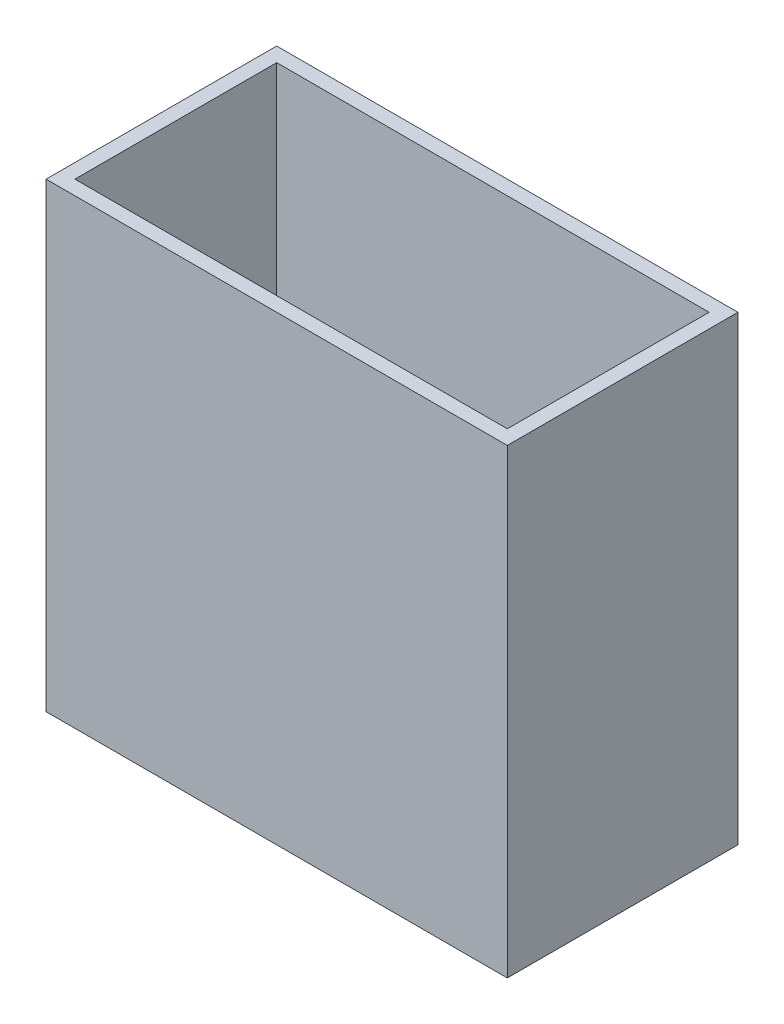
ISO-10303-21;
HEADER;
FILE_DESCRIPTION(('STEP AP214'),'2;1');
FILE_NAME('part.step','',(''),(''),'','','');
FILE_SCHEMA(('AUTOMOTIVE_DESIGN { 1 0 10303 214 1 1 1 1 }'));
ENDSEC;
DATA;
#1=APPLICATION_CONTEXT('core data for automotive mechanical design processes');
#2=APPLICATION_PROTOCOL_DEFINITION('international standard','automotive_design',2000,#1);
#3=PRODUCT_CONTEXT('',#1,'mechanical');
#4=PRODUCT('Part','Part','',(#3));
#5=PRODUCT_RELATED_PRODUCT_CATEGORY('part','',(#4));
#6=PRODUCT_DEFINITION_FORMATION('','',#4);
#7=PRODUCT_DEFINITION_CONTEXT('part definition',#1,'design');
#8=PRODUCT_DEFINITION('design','',#6,#7);
#9=PRODUCT_DEFINITION_SHAPE('','',#8);
#10=(LENGTH_UNIT() NAMED_UNIT(*) SI_UNIT(.MILLI.,.METRE.));
#11=(NAMED_UNIT(*) PLANE_ANGLE_UNIT() SI_UNIT($,.RADIAN.));
#12=(NAMED_UNIT(*) SI_UNIT($,.STERADIAN.) SOLID_ANGLE_UNIT());
#13=UNCERTAINTY_MEASURE_WITH_UNIT(LENGTH_MEASURE(1.E-05),#10,'distance_accuracy_value','');
#14=(GEOMETRIC_REPRESENTATION_CONTEXT(3) GLOBAL_UNCERTAINTY_ASSIGNED_CONTEXT((#13)) GLOBAL_UNIT_ASSIGNED_CONTEXT((#10,
#11,#12)) REPRESENTATION_CONTEXT('',''));
#15=CARTESIAN_POINT('',(0.,0.,0.));
#16=DIRECTION('',(0.,0.,1.));
#17=DIRECTION('',(1.,0.,0.));
#18=AXIS2_PLACEMENT_3D('',#15,#16,#17);
#19=CARTESIAN_POINT('',(0.,50.8,0.));
#20=DIRECTION('',(0.,1.,0.));
#21=DIRECTION('',(0.,0.,1.));
#22=AXIS2_PLACEMENT_3D('',#19,#20,#21);
#23=PLANE('',#22);
#24=DIRECTION('',(0.,0.,1.));
#25=VECTOR('',#24,1.);
#26=CARTESIAN_POINT('',(-26.5883040935672,50.8,-11.6602339181287));
#27=LINE('',#26,#25);
#28=CARTESIAN_POINT('',(-26.5883040935672,50.8,-11.6602339181287));
#29=VERTEX_POINT('',#28);
#30=CARTESIAN_POINT('',(-26.5883040935672,50.8,13.7397660818713));
#31=VERTEX_POINT('',#30);
#32=EDGE_CURVE('E153',#29,#31,#27,.T.);
#33=ORIENTED_EDGE('',*,*,#32,.T.);
#34=DIRECTION('',(1.,0.,0.));
#35=VECTOR('',#34,1.);
#36=CARTESIAN_POINT('',(-26.5883040935672,50.8,13.7397660818713));
#37=LINE('',#36,#35);
#38=CARTESIAN_POINT('',(24.2116959064328,50.8,13.7397660818713));
#39=VERTEX_POINT('',#38);
#40=EDGE_CURVE('E157',#31,#39,#37,.T.);
#41=ORIENTED_EDGE('',*,*,#40,.T.);
#42=DIRECTION('',(0.,0.,-1.));
#43=VECTOR('',#42,1.);
#44=CARTESIAN_POINT('',(24.2116959064328,50.8,-11.6602339181287));
#45=LINE('',#44,#43);
#46=CARTESIAN_POINT('',(24.2116959064328,50.8,-11.6602339181287));
#47=VERTEX_POINT('',#46);
#48=EDGE_CURVE('E161',#39,#47,#45,.T.);
#49=ORIENTED_EDGE('',*,*,#48,.T.);
#50=DIRECTION('',(-1.,0.,0.));
#51=VECTOR('',#50,1.);
#52=CARTESIAN_POINT('',(-26.5883040935672,50.8,-11.6602339181287));
#53=LINE('',#52,#51);
#54=EDGE_CURVE('E164',#47,#29,#53,.T.);
#55=ORIENTED_EDGE('',*,*,#54,.T.);
#56=EDGE_LOOP('',(#33,#41,#49,#55));
#57=FACE_BOUND('',#56,.T.);
#58=DIRECTION('',(1.,0.,0.));
#59=VECTOR('',#58,1.);
#60=CARTESIAN_POINT('',(-25.0008040935672,50.8,12.1522660818713));
#61=LINE('',#60,#59);
#62=CARTESIAN_POINT('',(-25.0008040935672,50.8,12.1522660818713));
#63=VERTEX_POINT('',#62);
#64=CARTESIAN_POINT('',(22.6241959064327,50.8,12.1522660818713));
#65=VERTEX_POINT('',#64);
#66=EDGE_CURVE('E114',#63,#65,#61,.T.);
#67=ORIENTED_EDGE('',*,*,#66,.F.);
#68=DIRECTION('',(0.,0.,1.));
#69=VECTOR('',#68,1.);
#70=CARTESIAN_POINT('',(-25.0008040935673,50.8,-10.0727339181287));
#71=LINE('',#70,#69);
#72=CARTESIAN_POINT('',(-25.0008040935673,50.8,-10.0727339181287));
#73=VERTEX_POINT('',#72);
#74=EDGE_CURVE('E105',#73,#63,#71,.T.);
#75=ORIENTED_EDGE('',*,*,#74,.F.);
#76=DIRECTION('',(-1.,0.,0.));
#77=VECTOR('',#76,1.);
#78=CARTESIAN_POINT('',(-25.0008040935673,50.8,-10.0727339181287));
#79=LINE('',#78,#77);
#80=CARTESIAN_POINT('',(22.6241959064327,50.8,-10.0727339181287));
#81=VERTEX_POINT('',#80);
#82=EDGE_CURVE('E131',#81,#73,#79,.T.);
#83=ORIENTED_EDGE('',*,*,#82,.F.);
#84=DIRECTION('',(0.,0.,-1.));
#85=VECTOR('',#84,1.);
#86=CARTESIAN_POINT('',(22.6241959064327,50.8,-10.0727339181287));
#87=LINE('',#86,#85);
#88=EDGE_CURVE('E127',#65,#81,#87,.T.);
#89=ORIENTED_EDGE('',*,*,#88,.F.);
#90=EDGE_LOOP('',(#67,#75,#83,#89));
#91=FACE_BOUND('',#90,.T.);
#92=ADVANCED_FACE('F39',(#57,#91),#23,.T.);
#93=CARTESIAN_POINT('',(0.,0.,0.));
#94=DIRECTION('',(0.,1.,0.));
#95=DIRECTION('',(0.,0.,1.));
#96=AXIS2_PLACEMENT_3D('',#93,#94,#95);
#97=PLANE('',#96);
#98=DIRECTION('',(0.,0.,1.));
#99=VECTOR('',#98,1.);
#100=CARTESIAN_POINT('',(-26.5883040935672,0.,-11.6602339181287));
#101=LINE('',#100,#99);
#102=CARTESIAN_POINT('',(-26.5883040935672,0.,-11.6602339181287));
#103=VERTEX_POINT('',#102);
#104=CARTESIAN_POINT('',(-26.5883040935672,0.,13.7397660818713));
#105=VERTEX_POINT('',#104);
#106=EDGE_CURVE('E123',#103,#105,#101,.T.);
#107=ORIENTED_EDGE('',*,*,#106,.F.);
#108=DIRECTION('',(-1.,0.,0.));
#109=VECTOR('',#108,1.);
#110=CARTESIAN_POINT('',(-26.5883040935672,0.,-11.6602339181287));
#111=LINE('',#110,#109);
#112=CARTESIAN_POINT('',(24.2116959064328,0.,-11.6602339181287));
#113=VERTEX_POINT('',#112);
#114=EDGE_CURVE('E158',#113,#103,#111,.T.);
#115=ORIENTED_EDGE('',*,*,#114,.F.);
#116=DIRECTION('',(0.,0.,-1.));
#117=VECTOR('',#116,1.);
#118=CARTESIAN_POINT('',(24.2116959064328,0.,-11.6602339181287));
#119=LINE('',#118,#117);
#120=CARTESIAN_POINT('',(24.2116959064328,0.,13.7397660818713));
#121=VERTEX_POINT('',#120);
#122=EDGE_CURVE('E174',#121,#113,#119,.T.);
#123=ORIENTED_EDGE('',*,*,#122,.F.);
#124=DIRECTION('',(1.,0.,0.));
#125=VECTOR('',#124,1.);
#126=CARTESIAN_POINT('',(-26.5883040935672,0.,13.7397660818713));
#127=LINE('',#126,#125);
#128=EDGE_CURVE('E171',#105,#121,#127,.T.);
#129=ORIENTED_EDGE('',*,*,#128,.F.);
#130=EDGE_LOOP('',(#107,#115,#123,#129));
#131=FACE_BOUND('',#130,.T.);
#132=DIRECTION('',(0.,0.,1.));
#133=VECTOR('',#132,1.);
#134=CARTESIAN_POINT('',(-25.0008040935673,0.,-10.0727339181287));
#135=LINE('',#134,#133);
#136=CARTESIAN_POINT('',(-25.0008040935673,0.,-10.0727339181287));
#137=VERTEX_POINT('',#136);
#138=CARTESIAN_POINT('',(-25.0008040935672,0.,12.1522660818713));
#139=VERTEX_POINT('',#138);
#140=EDGE_CURVE('E63',#137,#139,#135,.T.);
#141=ORIENTED_EDGE('',*,*,#140,.T.);
#142=DIRECTION('',(1.,0.,0.));
#143=VECTOR('',#142,1.);
#144=CARTESIAN_POINT('',(-25.0008040935672,0.,12.1522660818713));
#145=LINE('',#144,#143);
#146=CARTESIAN_POINT('',(22.6241959064327,0.,12.1522660818713));
#147=VERTEX_POINT('',#146);
#148=EDGE_CURVE('E121',#139,#147,#145,.T.);
#149=ORIENTED_EDGE('',*,*,#148,.T.);
#150=DIRECTION('',(0.,0.,-1.));
#151=VECTOR('',#150,1.);
#152=CARTESIAN_POINT('',(22.6241959064327,0.,-10.0727339181287));
#153=LINE('',#152,#151);
#154=CARTESIAN_POINT('',(22.6241959064327,0.,-10.0727339181287));
#155=VERTEX_POINT('',#154);
#156=EDGE_CURVE('E140',#147,#155,#153,.T.);
#157=ORIENTED_EDGE('',*,*,#156,.T.);
#158=DIRECTION('',(-1.,0.,0.));
#159=VECTOR('',#158,1.);
#160=CARTESIAN_POINT('',(-25.0008040935673,0.,-10.0727339181287));
#161=LINE('',#160,#159);
#162=EDGE_CURVE('E115',#155,#137,#161,.T.);
#163=ORIENTED_EDGE('',*,*,#162,.T.);
#164=EDGE_LOOP('',(#141,#149,#157,#163));
#165=FACE_BOUND('',#164,.T.);
#166=ADVANCED_FACE('F197',(#131,#165),#97,.F.);
#167=CARTESIAN_POINT('',(-26.5883040935672,50.8,-11.6602339181287));
#168=DIRECTION('',(1.,0.,0.));
#169=DIRECTION('',(0.,0.,-1.));
#170=AXIS2_PLACEMENT_3D('',#167,#168,#169);
#171=PLANE('',#170);
#172=ORIENTED_EDGE('',*,*,#106,.T.);
#173=DIRECTION('',(0.,-1.,0.));
#174=VECTOR('',#173,1.);
#175=CARTESIAN_POINT('',(-26.5883040935672,50.8,13.7397660818713));
#176=LINE('',#175,#174);
#177=EDGE_CURVE('E11',#31,#105,#176,.T.);
#178=ORIENTED_EDGE('',*,*,#177,.F.);
#179=ORIENTED_EDGE('',*,*,#32,.F.);
#180=DIRECTION('',(0.,-1.,0.));
#181=VECTOR('',#180,1.);
#182=CARTESIAN_POINT('',(-26.5883040935672,50.8,-11.6602339181287));
#183=LINE('',#182,#181);
#184=EDGE_CURVE('E167',#29,#103,#183,.T.);
#185=ORIENTED_EDGE('',*,*,#184,.T.);
#186=EDGE_LOOP('',(#172,#178,#179,#185));
#187=FACE_BOUND('',#186,.T.);
#188=ADVANCED_FACE('F41',(#187),#171,.F.);
#189=CARTESIAN_POINT('',(-26.5883040935672,50.8,13.7397660818713));
#190=DIRECTION('',(0.,0.,-1.));
#191=DIRECTION('',(-1.,0.,0.));
#192=AXIS2_PLACEMENT_3D('',#189,#190,#191);
#193=PLANE('',#192);
#194=ORIENTED_EDGE('',*,*,#128,.T.);
#195=DIRECTION('',(0.,-1.,0.));
#196=VECTOR('',#195,1.);
#197=CARTESIAN_POINT('',(24.2116959064328,50.8,13.7397660818713));
#198=LINE('',#197,#196);
#199=EDGE_CURVE('E48',#39,#121,#198,.T.);
#200=ORIENTED_EDGE('',*,*,#199,.F.);
#201=ORIENTED_EDGE('',*,*,#40,.F.);
#202=ORIENTED_EDGE('',*,*,#177,.T.);
#203=EDGE_LOOP('',(#194,#200,#201,#202));
#204=FACE_BOUND('',#203,.T.);
#205=ADVANCED_FACE('F207',(#204),#193,.F.);
#206=CARTESIAN_POINT('',(24.2116959064328,50.8,-11.6602339181287));
#207=DIRECTION('',(-1.,0.,0.));
#208=DIRECTION('',(0.,0.,1.));
#209=AXIS2_PLACEMENT_3D('',#206,#207,#208);
#210=PLANE('',#209);
#211=ORIENTED_EDGE('',*,*,#122,.T.);
#212=DIRECTION('',(0.,-1.,0.));
#213=VECTOR('',#212,1.);
#214=CARTESIAN_POINT('',(24.2116959064328,50.8,-11.6602339181287));
#215=LINE('',#214,#213);
#216=EDGE_CURVE('E182',#47,#113,#215,.T.);
#217=ORIENTED_EDGE('',*,*,#216,.F.);
#218=ORIENTED_EDGE('',*,*,#48,.F.);
#219=ORIENTED_EDGE('',*,*,#199,.T.);
#220=EDGE_LOOP('',(#211,#217,#218,#219));
#221=FACE_BOUND('',#220,.T.);
#222=ADVANCED_FACE('F191',(#221),#210,.F.);
#223=CARTESIAN_POINT('',(-26.5883040935672,50.8,-11.6602339181287));
#224=DIRECTION('',(0.,0.,1.));
#225=DIRECTION('',(1.,0.,0.));
#226=AXIS2_PLACEMENT_3D('',#223,#224,#225);
#227=PLANE('',#226);
#228=ORIENTED_EDGE('',*,*,#114,.T.);
#229=ORIENTED_EDGE('',*,*,#184,.F.);
#230=ORIENTED_EDGE('',*,*,#54,.F.);
#231=ORIENTED_EDGE('',*,*,#216,.T.);
#232=EDGE_LOOP('',(#228,#229,#230,#231));
#233=FACE_BOUND('',#232,.T.);
#234=ADVANCED_FACE('F201',(#233),#227,.F.);
#235=CARTESIAN_POINT('',(-25.0008040935673,50.8,-10.0727339181287));
#236=DIRECTION('',(1.,0.,0.));
#237=DIRECTION('',(0.,0.,-1.));
#238=AXIS2_PLACEMENT_3D('',#235,#236,#237);
#239=PLANE('',#238);
#240=ORIENTED_EDGE('',*,*,#140,.F.);
#241=DIRECTION('',(0.,-1.,0.));
#242=VECTOR('',#241,1.);
#243=CARTESIAN_POINT('',(-25.0008040935673,50.8,-10.0727339181287));
#244=LINE('',#243,#242);
#245=EDGE_CURVE('E109',#73,#137,#244,.T.);
#246=ORIENTED_EDGE('',*,*,#245,.F.);
#247=ORIENTED_EDGE('',*,*,#74,.T.);
#248=DIRECTION('',(0.,-1.,0.));
#249=VECTOR('',#248,1.);
#250=CARTESIAN_POINT('',(-25.0008040935672,50.8,12.1522660818713));
#251=LINE('',#250,#249);
#252=EDGE_CURVE('E108',#63,#139,#251,.T.);
#253=ORIENTED_EDGE('',*,*,#252,.T.);
#254=EDGE_LOOP('',(#240,#246,#247,#253));
#255=FACE_BOUND('',#254,.T.);
#256=ADVANCED_FACE('F107',(#255),#239,.T.);
#257=CARTESIAN_POINT('',(-25.0008040935672,50.8,12.1522660818713));
#258=DIRECTION('',(0.,0.,-1.));
#259=DIRECTION('',(-1.,0.,0.));
#260=AXIS2_PLACEMENT_3D('',#257,#258,#259);
#261=PLANE('',#260);
#262=ORIENTED_EDGE('',*,*,#148,.F.);
#263=ORIENTED_EDGE('',*,*,#252,.F.);
#264=ORIENTED_EDGE('',*,*,#66,.T.);
#265=DIRECTION('',(0.,-1.,0.));
#266=VECTOR('',#265,1.);
#267=CARTESIAN_POINT('',(22.6241959064327,50.8,12.1522660818713));
#268=LINE('',#267,#266);
#269=EDGE_CURVE('E124',#65,#147,#268,.T.);
#270=ORIENTED_EDGE('',*,*,#269,.T.);
#271=EDGE_LOOP('',(#262,#263,#264,#270));
#272=FACE_BOUND('',#271,.T.);
#273=ADVANCED_FACE('F118',(#272),#261,.T.);
#274=CARTESIAN_POINT('',(22.6241959064327,50.8,-10.0727339181287));
#275=DIRECTION('',(-1.,0.,0.));
#276=DIRECTION('',(0.,0.,1.));
#277=AXIS2_PLACEMENT_3D('',#274,#275,#276);
#278=PLANE('',#277);
#279=ORIENTED_EDGE('',*,*,#156,.F.);
#280=ORIENTED_EDGE('',*,*,#269,.F.);
#281=ORIENTED_EDGE('',*,*,#88,.T.);
#282=DIRECTION('',(0.,-1.,0.));
#283=VECTOR('',#282,1.);
#284=CARTESIAN_POINT('',(22.6241959064327,50.8,-10.0727339181287));
#285=LINE('',#284,#283);
#286=EDGE_CURVE('E55',#81,#155,#285,.T.);
#287=ORIENTED_EDGE('',*,*,#286,.T.);
#288=EDGE_LOOP('',(#279,#280,#281,#287));
#289=FACE_BOUND('',#288,.T.);
#290=ADVANCED_FACE('F230',(#289),#278,.T.);
#291=CARTESIAN_POINT('',(-25.0008040935673,50.8,-10.0727339181287));
#292=DIRECTION('',(0.,0.,1.));
#293=DIRECTION('',(1.,0.,0.));
#294=AXIS2_PLACEMENT_3D('',#291,#292,#293);
#295=PLANE('',#294);
#296=ORIENTED_EDGE('',*,*,#162,.F.);
#297=ORIENTED_EDGE('',*,*,#286,.F.);
#298=ORIENTED_EDGE('',*,*,#82,.T.);
#299=ORIENTED_EDGE('',*,*,#245,.T.);
#300=EDGE_LOOP('',(#296,#297,#298,#299));
#301=FACE_BOUND('',#300,.T.);
#302=ADVANCED_FACE('F234',(#301),#295,.T.);
#303=CLOSED_SHELL('',(#92,#166,#188,#205,#222,#234,#256,#273,#290,#302));
#304=MANIFOLD_SOLID_BREP('B2',#303);
#305=ADVANCED_BREP_SHAPE_REPRESENTATION('',(#18,#304),#14);
#306=SHAPE_DEFINITION_REPRESENTATION(#9,#305);
ENDSEC;
END-ISO-10303-21;
